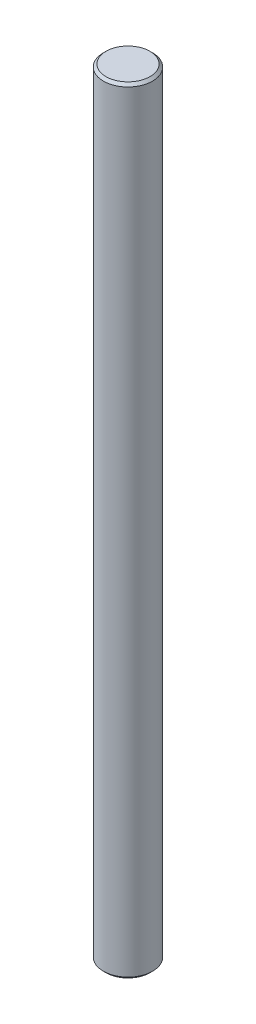
ISO-10303-21;
HEADER;
FILE_DESCRIPTION(('STEP AP214'),'2;1');
FILE_NAME('part.step','',(''),(''),'','','');
FILE_SCHEMA(('AUTOMOTIVE_DESIGN { 1 0 10303 214 1 1 1 1 }'));
ENDSEC;
DATA;
#1=APPLICATION_CONTEXT('core data for automotive mechanical design processes');
#2=APPLICATION_PROTOCOL_DEFINITION('international standard','automotive_design',2000,#1);
#3=PRODUCT_CONTEXT('',#1,'mechanical');
#4=PRODUCT('Part','Part','',(#3));
#5=PRODUCT_RELATED_PRODUCT_CATEGORY('part','',(#4));
#6=PRODUCT_DEFINITION_FORMATION('','',#4);
#7=PRODUCT_DEFINITION_CONTEXT('part definition',#1,'design');
#8=PRODUCT_DEFINITION('design','',#6,#7);
#9=PRODUCT_DEFINITION_SHAPE('','',#8);
#10=(LENGTH_UNIT() NAMED_UNIT(*) SI_UNIT(.MILLI.,.METRE.));
#11=(NAMED_UNIT(*) PLANE_ANGLE_UNIT() SI_UNIT($,.RADIAN.));
#12=(NAMED_UNIT(*) SI_UNIT($,.STERADIAN.) SOLID_ANGLE_UNIT());
#13=UNCERTAINTY_MEASURE_WITH_UNIT(LENGTH_MEASURE(1.E-05),#10,'distance_accuracy_value','');
#14=(GEOMETRIC_REPRESENTATION_CONTEXT(3) GLOBAL_UNCERTAINTY_ASSIGNED_CONTEXT((#13)) GLOBAL_UNIT_ASSIGNED_CONTEXT((#10,
#11,#12)) REPRESENTATION_CONTEXT('',''));
#15=CARTESIAN_POINT('',(0.,0.,0.));
#16=DIRECTION('',(0.,0.,1.));
#17=DIRECTION('',(1.,0.,0.));
#18=AXIS2_PLACEMENT_3D('',#15,#16,#17);
#19=CARTESIAN_POINT('',(0.,76.2,0.));
#20=DIRECTION('',(0.,-1.,0.));
#21=DIRECTION('',(0.,0.,-1.));
#22=AXIS2_PLACEMENT_3D('',#19,#20,#21);
#23=CYLINDRICAL_SURFACE('',#22,2.413);
#24=CARTESIAN_POINT('',(0.,75.946,0.));
#25=DIRECTION('',(0.,1.,0.));
#26=DIRECTION('',(0.,0.,1.));
#27=AXIS2_PLACEMENT_3D('',#24,#25,#26);
#28=CIRCLE('',#27,2.413);
#29=CARTESIAN_POINT('',(0.,75.946,2.413));
#30=VERTEX_POINT('',#29);
#31=EDGE_CURVE('E40',#30,#30,#28,.F.);
#32=ORIENTED_EDGE('',*,*,#31,.T.);
#33=EDGE_LOOP('',(#32));
#34=FACE_BOUND('',#33,.T.);
#35=CARTESIAN_POINT('',(0.,0.254000000000074,0.));
#36=DIRECTION('',(0.,1.,0.));
#37=DIRECTION('',(0.,0.,1.));
#38=AXIS2_PLACEMENT_3D('',#35,#36,#37);
#39=CIRCLE('',#38,2.413);
#40=CARTESIAN_POINT('',(0.,0.254000000000074,2.413));
#41=VERTEX_POINT('',#40);
#42=EDGE_CURVE('E44',#41,#41,#39,.T.);
#43=ORIENTED_EDGE('',*,*,#42,.T.);
#44=EDGE_LOOP('',(#43));
#45=FACE_BOUND('',#44,.T.);
#46=ADVANCED_FACE('F33',(#34,#45),#23,.T.);
#47=CARTESIAN_POINT('',(0.,76.2,0.));
#48=DIRECTION('',(0.,1.,0.));
#49=DIRECTION('',(0.,0.,1.));
#50=AXIS2_PLACEMENT_3D('',#47,#48,#49);
#51=PLANE('',#50);
#52=CARTESIAN_POINT('',(0.,76.2,0.));
#53=DIRECTION('',(0.,1.,0.));
#54=DIRECTION('',(0.,0.,1.));
#55=AXIS2_PLACEMENT_3D('',#52,#53,#54);
#56=CIRCLE('',#55,2.15900000000002);
#57=CARTESIAN_POINT('',(0.,76.2,2.15900000000002));
#58=VERTEX_POINT('',#57);
#59=EDGE_CURVE('E48',#58,#58,#56,.T.);
#60=ORIENTED_EDGE('',*,*,#59,.T.);
#61=EDGE_LOOP('',(#60));
#62=FACE_BOUND('',#61,.T.);
#63=ADVANCED_FACE('F54',(#62),#51,.T.);
#64=CARTESIAN_POINT('',(0.,0.,0.));
#65=DIRECTION('',(0.,1.,0.));
#66=DIRECTION('',(0.,0.,1.));
#67=AXIS2_PLACEMENT_3D('',#64,#65,#66);
#68=PLANE('',#67);
#69=CARTESIAN_POINT('',(0.,0.,0.));
#70=DIRECTION('',(0.,1.,0.));
#71=DIRECTION('',(0.,0.,1.));
#72=AXIS2_PLACEMENT_3D('',#69,#70,#71);
#73=CIRCLE('',#72,2.15899999999994);
#74=CARTESIAN_POINT('',(0.,0.,2.15899999999994));
#75=VERTEX_POINT('',#74);
#76=EDGE_CURVE('E10',#75,#75,#73,.F.);
#77=ORIENTED_EDGE('',*,*,#76,.T.);
#78=EDGE_LOOP('',(#77));
#79=FACE_BOUND('',#78,.T.);
#80=ADVANCED_FACE('F58',(#79),#68,.F.);
#81=CARTESIAN_POINT('',(0.,76.2,0.));
#82=DIRECTION('',(0.,-1.,0.));
#83=DIRECTION('',(0.,0.,-1.));
#84=AXIS2_PLACEMENT_3D('',#81,#82,#83);
#85=CONICAL_SURFACE('',#84,2.15900000000002,0.785398163397452);
#86=ORIENTED_EDGE('',*,*,#31,.F.);
#87=EDGE_LOOP('',(#86));
#88=FACE_BOUND('',#87,.T.);
#89=ORIENTED_EDGE('',*,*,#59,.F.);
#90=EDGE_LOOP('',(#89));
#91=FACE_BOUND('',#90,.T.);
#92=ADVANCED_FACE('F56',(#88,#91),#85,.T.);
#93=CARTESIAN_POINT('',(0.,0.25400000000006,0.));
#94=DIRECTION('',(0.,1.,0.));
#95=DIRECTION('',(0.,0.,1.));
#96=AXIS2_PLACEMENT_3D('',#93,#94,#95);
#97=CONICAL_SURFACE('',#96,2.413,0.785398163397452);
#98=ORIENTED_EDGE('',*,*,#76,.F.);
#99=EDGE_LOOP('',(#98));
#100=FACE_BOUND('',#99,.T.);
#101=ORIENTED_EDGE('',*,*,#42,.F.);
#102=EDGE_LOOP('',(#101));
#103=FACE_BOUND('',#102,.T.);
#104=ADVANCED_FACE('F35',(#100,#103),#97,.T.);
#105=CLOSED_SHELL('',(#46,#63,#80,#92,#104));
#106=MANIFOLD_SOLID_BREP('B2',#105);
#107=ADVANCED_BREP_SHAPE_REPRESENTATION('',(#18,#106),#14);
#108=SHAPE_DEFINITION_REPRESENTATION(#9,#107);
ENDSEC;
END-ISO-10303-21;
